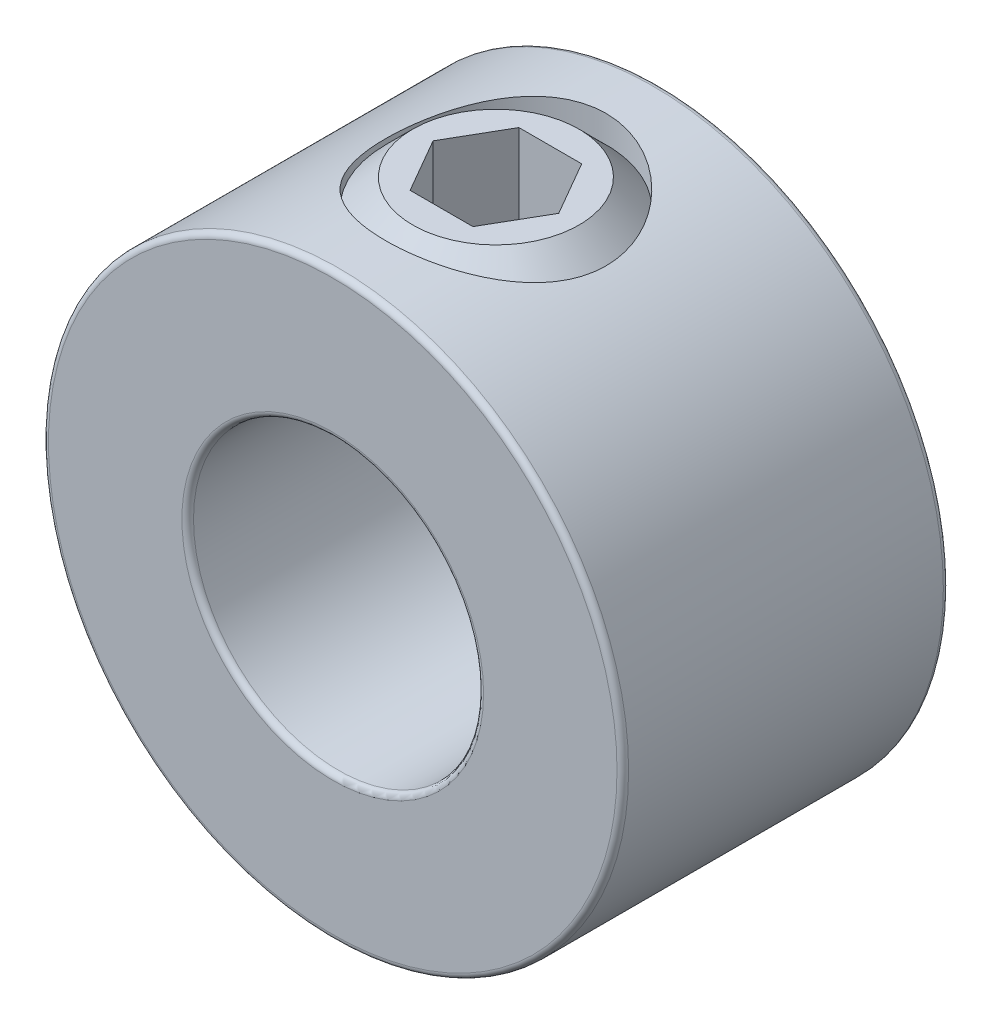
ISO-10303-21;
HEADER;
FILE_DESCRIPTION(('STEP AP214'),'2;1');
FILE_NAME('part.step','',(''),(''),'','','');
FILE_SCHEMA(('AUTOMOTIVE_DESIGN { 1 0 10303 214 1 1 1 1 }'));
ENDSEC;
DATA;
#1=APPLICATION_CONTEXT('core data for automotive mechanical design processes');
#2=APPLICATION_PROTOCOL_DEFINITION('international standard','automotive_design',2000,#1);
#3=PRODUCT_CONTEXT('',#1,'mechanical');
#4=PRODUCT('Part','Part','',(#3));
#5=PRODUCT_RELATED_PRODUCT_CATEGORY('part','',(#4));
#6=PRODUCT_DEFINITION_FORMATION('','',#4);
#7=PRODUCT_DEFINITION_CONTEXT('part definition',#1,'design');
#8=PRODUCT_DEFINITION('design','',#6,#7);
#9=PRODUCT_DEFINITION_SHAPE('','',#8);
#10=(LENGTH_UNIT() NAMED_UNIT(*) SI_UNIT(.MILLI.,.METRE.));
#11=(NAMED_UNIT(*) PLANE_ANGLE_UNIT() SI_UNIT($,.RADIAN.));
#12=(NAMED_UNIT(*) SI_UNIT($,.STERADIAN.) SOLID_ANGLE_UNIT());
#13=UNCERTAINTY_MEASURE_WITH_UNIT(LENGTH_MEASURE(1.E-05),#10,'distance_accuracy_value','');
#14=(GEOMETRIC_REPRESENTATION_CONTEXT(3) GLOBAL_UNCERTAINTY_ASSIGNED_CONTEXT((#13)) GLOBAL_UNIT_ASSIGNED_CONTEXT((#10,
#11,#12)) REPRESENTATION_CONTEXT('',''));
#15=CARTESIAN_POINT('',(0.,0.,0.));
#16=DIRECTION('',(0.,0.,1.));
#17=DIRECTION('',(1.,0.,0.));
#18=AXIS2_PLACEMENT_3D('',#15,#16,#17);
#19=CARTESIAN_POINT('',(0.,6.34999999999995,0.));
#20=DIRECTION('',(0.,1.,0.));
#21=DIRECTION('',(-1.,0.,0.));
#22=AXIS2_PLACEMENT_3D('',#19,#20,#21);
#23=PLANE('',#22);
#24=CARTESIAN_POINT('',(0.,6.34999999999995,0.));
#25=DIRECTION('',(0.,1.,0.));
#26=DIRECTION('',(-1.,0.,0.));
#27=AXIS2_PLACEMENT_3D('',#24,#25,#26);
#28=CIRCLE('',#27,1.81975161629017);
#29=CARTESIAN_POINT('',(-1.81975161629018,6.34999999999995,0.));
#30=VERTEX_POINT('',#29);
#31=EDGE_CURVE('E12',#30,#30,#28,.T.);
#32=ORIENTED_EDGE('',*,*,#31,.T.);
#33=EDGE_LOOP('',(#32));
#34=FACE_BOUND('',#33,.T.);
#35=DIRECTION('',(1.,0.,0.));
#36=VECTOR('',#35,1.);
#37=CARTESIAN_POINT('',(-0.687407664253931,6.34999999999996,-1.19062499999997));
#38=LINE('',#37,#36);
#39=CARTESIAN_POINT('',(-0.687407664253931,6.34999999999996,-1.19062499999997));
#40=VERTEX_POINT('',#39);
#41=CARTESIAN_POINT('',(0.687407664253896,6.34999999999998,-1.19062499999999));
#42=VERTEX_POINT('',#41);
#43=EDGE_CURVE('E112',#40,#42,#38,.T.);
#44=ORIENTED_EDGE('',*,*,#43,.T.);
#45=DIRECTION('',(0.5,0.,0.866025403784438));
#46=VECTOR('',#45,1.);
#47=CARTESIAN_POINT('',(0.687407664253896,6.34999999999995,-1.19062499999997));
#48=LINE('',#47,#46);
#49=CARTESIAN_POINT('',(1.37481532850779,6.34999999999995,0.));
#50=VERTEX_POINT('',#49);
#51=EDGE_CURVE('E58',#42,#50,#48,.T.);
#52=ORIENTED_EDGE('',*,*,#51,.T.);
#53=DIRECTION('',(-0.5,0.,0.866025403784439));
#54=VECTOR('',#53,1.);
#55=CARTESIAN_POINT('',(1.37481532850779,6.34999999999995,0.));
#56=LINE('',#55,#54);
#57=CARTESIAN_POINT('',(0.687407664253896,6.34999999999999,1.190625));
#58=VERTEX_POINT('',#57);
#59=EDGE_CURVE('E116',#50,#58,#56,.T.);
#60=ORIENTED_EDGE('',*,*,#59,.T.);
#61=DIRECTION('',(-1.,0.,0.));
#62=VECTOR('',#61,1.);
#63=CARTESIAN_POINT('',(0.687407664253896,6.34999999999999,1.190625));
#64=LINE('',#63,#62);
#65=CARTESIAN_POINT('',(-0.687407664253924,6.34999999999994,1.19062500000003));
#66=VERTEX_POINT('',#65);
#67=EDGE_CURVE('E179',#58,#66,#64,.T.);
#68=ORIENTED_EDGE('',*,*,#67,.T.);
#69=DIRECTION('',(-0.5,0.,-0.866025403784438));
#70=VECTOR('',#69,1.);
#71=CARTESIAN_POINT('',(-0.687407664253924,6.34999999999994,1.19062500000003));
#72=LINE('',#71,#70);
#73=CARTESIAN_POINT('',(-1.37481532850781,6.34999999999995,0.));
#74=VERTEX_POINT('',#73);
#75=EDGE_CURVE('E164',#66,#74,#72,.T.);
#76=ORIENTED_EDGE('',*,*,#75,.T.);
#77=DIRECTION('',(0.5,0.,-0.866025403784439));
#78=VECTOR('',#77,1.);
#79=CARTESIAN_POINT('',(-1.37481532850781,6.34999999999995,0.));
#80=LINE('',#79,#78);
#81=EDGE_CURVE('E160',#74,#40,#80,.T.);
#82=ORIENTED_EDGE('',*,*,#81,.T.);
#83=EDGE_LOOP('',(#44,#52,#60,#68,#76,#82));
#84=FACE_BOUND('',#83,.T.);
#85=ADVANCED_FACE('F44',(#34,#84),#23,.T.);
#86=CARTESIAN_POINT('',(0.,6.34999999999995,0.));
#87=DIRECTION('',(0.,-1.,0.));
#88=DIRECTION('',(1.,0.,0.));
#89=AXIS2_PLACEMENT_3D('',#86,#87,#88);
#90=CONICAL_SURFACE('',#89,1.81975161629017,0.785398163397449);
#91=CARTESIAN_POINT('',(0.,5.75675161629011,0.));
#92=DIRECTION('',(0.,1.,0.));
#93=DIRECTION('',(-1.,0.,0.));
#94=AXIS2_PLACEMENT_3D('',#91,#92,#93);
#95=CIRCLE('',#94,2.413);
#96=CARTESIAN_POINT('',(-2.41300000000002,5.75675161629011,0.));
#97=VERTEX_POINT('',#96);
#98=EDGE_CURVE('E51',#97,#97,#95,.T.);
#99=ORIENTED_EDGE('',*,*,#98,.T.);
#100=EDGE_LOOP('',(#99));
#101=FACE_BOUND('',#100,.T.);
#102=ORIENTED_EDGE('',*,*,#31,.F.);
#103=EDGE_LOOP('',(#102));
#104=FACE_BOUND('',#103,.T.);
#105=ADVANCED_FACE('F134',(#101,#104),#90,.T.);
#106=CARTESIAN_POINT('',(0.,3.17499999999996,0.));
#107=DIRECTION('',(0.,1.,0.));
#108=DIRECTION('',(-1.,0.,0.));
#109=AXIS2_PLACEMENT_3D('',#106,#107,#108);
#110=CYLINDRICAL_SURFACE('',#109,2.413);
#111=CARTESIAN_POINT('',(0.,3.76824838370981,0.));
#112=DIRECTION('',(0.,1.,0.));
#113=DIRECTION('',(-1.,0.,0.));
#114=AXIS2_PLACEMENT_3D('',#111,#112,#113);
#115=CIRCLE('',#114,2.413);
#116=CARTESIAN_POINT('',(-2.41300000000005,3.76824838370981,0.));
#117=VERTEX_POINT('',#116);
#118=EDGE_CURVE('E129',#117,#117,#115,.T.);
#119=ORIENTED_EDGE('',*,*,#118,.T.);
#120=EDGE_LOOP('',(#119));
#121=FACE_BOUND('',#120,.T.);
#122=ORIENTED_EDGE('',*,*,#98,.F.);
#123=EDGE_LOOP('',(#122));
#124=FACE_BOUND('',#123,.T.);
#125=ADVANCED_FACE('F137',(#121,#124),#110,.T.);
#126=CARTESIAN_POINT('',(0.,3.76824838370981,0.));
#127=DIRECTION('',(0.,1.,0.));
#128=DIRECTION('',(-1.,0.,0.));
#129=AXIS2_PLACEMENT_3D('',#126,#127,#128);
#130=CONICAL_SURFACE('',#129,2.413,0.785398163397448);
#131=CARTESIAN_POINT('',(0.,3.17499999999996,0.));
#132=DIRECTION('',(0.,1.,0.));
#133=DIRECTION('',(-1.,0.,0.));
#134=AXIS2_PLACEMENT_3D('',#131,#132,#133);
#135=CIRCLE('',#134,1.81975161629017);
#136=CARTESIAN_POINT('',(-1.81975161629015,3.17499999999996,0.));
#137=VERTEX_POINT('',#136);
#138=EDGE_CURVE('E121',#137,#137,#135,.T.);
#139=ORIENTED_EDGE('',*,*,#138,.T.);
#140=EDGE_LOOP('',(#139));
#141=FACE_BOUND('',#140,.T.);
#142=ORIENTED_EDGE('',*,*,#118,.F.);
#143=EDGE_LOOP('',(#142));
#144=FACE_BOUND('',#143,.T.);
#145=ADVANCED_FACE('F139',(#141,#144),#130,.T.);
#146=CARTESIAN_POINT('',(-1.81975161629017,3.17499999999993,0.));
#147=DIRECTION('',(0.,-1.,0.));
#148=DIRECTION('',(1.,0.,0.));
#149=AXIS2_PLACEMENT_3D('',#146,#147,#148);
#150=PLANE('',#149);
#151=CARTESIAN_POINT('',(0.,3.17499999999996,0.));
#152=DIRECTION('',(0.,1.,0.));
#153=DIRECTION('',(-1.,0.,0.));
#154=AXIS2_PLACEMENT_3D('',#151,#152,#153);
#155=CIRCLE('',#154,0.711898060451796);
#156=CARTESIAN_POINT('',(-0.711898060451782,3.17499999999996,0.));
#157=VERTEX_POINT('',#156);
#158=EDGE_CURVE('E117',#157,#157,#155,.T.);
#159=ORIENTED_EDGE('',*,*,#158,.T.);
#160=EDGE_LOOP('',(#159));
#161=FACE_BOUND('',#160,.T.);
#162=ORIENTED_EDGE('',*,*,#138,.F.);
#163=EDGE_LOOP('',(#162));
#164=FACE_BOUND('',#163,.T.);
#165=ADVANCED_FACE('F146',(#161,#164),#150,.T.);
#166=CARTESIAN_POINT('',(0.,3.17499999999996,0.));
#167=DIRECTION('',(0.,-1.,0.));
#168=DIRECTION('',(1.,0.,0.));
#169=AXIS2_PLACEMENT_3D('',#166,#167,#168);
#170=CONICAL_SURFACE('',#169,0.711898060451796,0.785398163397448);
#171=CARTESIAN_POINT('',(0.,3.88689806045177,0.));
#172=VERTEX_POINT('',#171);
#173=VERTEX_LOOP('',#172);
#174=FACE_BOUND('',#173,.T.);
#175=ORIENTED_EDGE('',*,*,#158,.F.);
#176=EDGE_LOOP('',(#175));
#177=FACE_BOUND('',#176,.T.);
#178=ADVANCED_FACE('F213',(#174,#177),#170,.F.);
#179=CARTESIAN_POINT('',(0.687407664253903,3.96874999999994,-1.19062499999995));
#180=DIRECTION('',(-0.866025403784439,0.,0.5));
#181=DIRECTION('',(0.5,0.,0.866025403784438));
#182=AXIS2_PLACEMENT_3D('',#179,#180,#181);
#183=PLANE('',#182);
#184=ORIENTED_EDGE('',*,*,#51,.F.);
#185=DIRECTION('',(0.,1.,0.));
#186=VECTOR('',#185,1.);
#187=CARTESIAN_POINT('',(0.687407664253903,3.96874999999994,-1.19062499999995));
#188=LINE('',#187,#186);
#189=CARTESIAN_POINT('',(0.687407664253903,3.96874999999994,-1.19062499999995));
#190=VERTEX_POINT('',#189);
#191=EDGE_CURVE('E111',#190,#42,#188,.T.);
#192=ORIENTED_EDGE('',*,*,#191,.F.);
#193=DIRECTION('',(0.5,0.,0.866025403784438));
#194=VECTOR('',#193,1.);
#195=CARTESIAN_POINT('',(0.687407664253903,3.96874999999994,-1.19062499999995));
#196=LINE('',#195,#194);
#197=CARTESIAN_POINT('',(1.37481532850781,3.96874999999994,0.));
#198=VERTEX_POINT('',#197);
#199=EDGE_CURVE('E102',#190,#198,#196,.T.);
#200=ORIENTED_EDGE('',*,*,#199,.T.);
#201=DIRECTION('',(0.,1.,0.));
#202=VECTOR('',#201,1.);
#203=CARTESIAN_POINT('',(1.37481532850781,3.96874999999994,0.));
#204=LINE('',#203,#202);
#205=EDGE_CURVE('E110',#198,#50,#204,.T.);
#206=ORIENTED_EDGE('',*,*,#205,.T.);
#207=EDGE_LOOP('',(#184,#192,#200,#206));
#208=FACE_BOUND('',#207,.T.);
#209=ADVANCED_FACE('F109',(#208),#183,.T.);
#210=CARTESIAN_POINT('',(1.37481532850781,3.96874999999994,0.));
#211=DIRECTION('',(-0.866025403784438,0.,-0.5));
#212=DIRECTION('',(-0.5,0.,0.866025403784439));
#213=AXIS2_PLACEMENT_3D('',#210,#211,#212);
#214=PLANE('',#213);
#215=ORIENTED_EDGE('',*,*,#59,.F.);
#216=ORIENTED_EDGE('',*,*,#205,.F.);
#217=DIRECTION('',(-0.5,0.,0.866025403784439));
#218=VECTOR('',#217,1.);
#219=CARTESIAN_POINT('',(1.37481532850781,3.96874999999994,0.));
#220=LINE('',#219,#218);
#221=CARTESIAN_POINT('',(0.687407664253924,3.96874999999994,1.19062500000003));
#222=VERTEX_POINT('',#221);
#223=EDGE_CURVE('E98',#198,#222,#220,.T.);
#224=ORIENTED_EDGE('',*,*,#223,.T.);
#225=DIRECTION('',(0.,1.,0.));
#226=VECTOR('',#225,1.);
#227=CARTESIAN_POINT('',(0.687407664253924,3.96874999999994,1.19062500000003));
#228=LINE('',#227,#226);
#229=EDGE_CURVE('E118',#222,#58,#228,.T.);
#230=ORIENTED_EDGE('',*,*,#229,.T.);
#231=EDGE_LOOP('',(#215,#216,#224,#230));
#232=FACE_BOUND('',#231,.T.);
#233=ADVANCED_FACE('F114',(#232),#214,.T.);
#234=CARTESIAN_POINT('',(0.687407664253924,3.96874999999994,1.19062500000003));
#235=DIRECTION('',(0.,0.,-1.));
#236=DIRECTION('',(-1.,0.,0.));
#237=AXIS2_PLACEMENT_3D('',#234,#235,#236);
#238=PLANE('',#237);
#239=ORIENTED_EDGE('',*,*,#67,.F.);
#240=ORIENTED_EDGE('',*,*,#229,.F.);
#241=DIRECTION('',(-1.,0.,0.));
#242=VECTOR('',#241,1.);
#243=CARTESIAN_POINT('',(0.687407664253924,3.96874999999994,1.19062500000003));
#244=LINE('',#243,#242);
#245=CARTESIAN_POINT('',(-0.68740766425391,3.96874999999993,1.19062500000001));
#246=VERTEX_POINT('',#245);
#247=EDGE_CURVE('E104',#222,#246,#244,.T.);
#248=ORIENTED_EDGE('',*,*,#247,.T.);
#249=DIRECTION('',(0.,1.,0.));
#250=VECTOR('',#249,1.);
#251=CARTESIAN_POINT('',(-0.68740766425391,3.96874999999993,1.19062500000001));
#252=LINE('',#251,#250);
#253=EDGE_CURVE('E123',#246,#66,#252,.T.);
#254=ORIENTED_EDGE('',*,*,#253,.T.);
#255=EDGE_LOOP('',(#239,#240,#248,#254));
#256=FACE_BOUND('',#255,.T.);
#257=ADVANCED_FACE('F177',(#256),#238,.T.);
#258=CARTESIAN_POINT('',(-0.68740766425391,3.96874999999993,1.19062500000001));
#259=DIRECTION('',(0.866025403784438,0.,-0.5));
#260=DIRECTION('',(-0.5,0.,-0.866025403784438));
#261=AXIS2_PLACEMENT_3D('',#258,#259,#260);
#262=PLANE('',#261);
#263=ORIENTED_EDGE('',*,*,#75,.F.);
#264=ORIENTED_EDGE('',*,*,#253,.F.);
#265=DIRECTION('',(-0.5,0.,-0.866025403784438));
#266=VECTOR('',#265,1.);
#267=CARTESIAN_POINT('',(-0.68740766425391,3.96874999999993,1.19062500000001));
#268=LINE('',#267,#266);
#269=CARTESIAN_POINT('',(-1.37481532850782,3.96874999999994,0.));
#270=VERTEX_POINT('',#269);
#271=EDGE_CURVE('E190',#246,#270,#268,.T.);
#272=ORIENTED_EDGE('',*,*,#271,.T.);
#273=DIRECTION('',(0.,1.,0.));
#274=VECTOR('',#273,1.);
#275=CARTESIAN_POINT('',(-1.37481532850782,3.96874999999994,0.));
#276=LINE('',#275,#274);
#277=EDGE_CURVE('E172',#270,#74,#276,.T.);
#278=ORIENTED_EDGE('',*,*,#277,.T.);
#279=EDGE_LOOP('',(#263,#264,#272,#278));
#280=FACE_BOUND('',#279,.T.);
#281=ADVANCED_FACE('F181',(#280),#262,.T.);
#282=CARTESIAN_POINT('',(-1.37481532850782,3.96874999999994,0.));
#283=DIRECTION('',(0.866025403784438,0.,0.499999999999999));
#284=DIRECTION('',(0.5,0.,-0.866025403784439));
#285=AXIS2_PLACEMENT_3D('',#282,#283,#284);
#286=PLANE('',#285);
#287=ORIENTED_EDGE('',*,*,#81,.F.);
#288=ORIENTED_EDGE('',*,*,#277,.F.);
#289=DIRECTION('',(0.5,0.,-0.866025403784439));
#290=VECTOR('',#289,1.);
#291=CARTESIAN_POINT('',(-1.37481532850782,3.96874999999994,0.));
#292=LINE('',#291,#290);
#293=CARTESIAN_POINT('',(-0.687407664253924,3.96874999999995,-1.19062499999997));
#294=VERTEX_POINT('',#293);
#295=EDGE_CURVE('E188',#270,#294,#292,.T.);
#296=ORIENTED_EDGE('',*,*,#295,.T.);
#297=DIRECTION('',(0.,1.,0.));
#298=VECTOR('',#297,1.);
#299=CARTESIAN_POINT('',(-0.687407664253924,3.96874999999995,-1.19062499999997));
#300=LINE('',#299,#298);
#301=EDGE_CURVE('E169',#294,#40,#300,.T.);
#302=ORIENTED_EDGE('',*,*,#301,.T.);
#303=EDGE_LOOP('',(#287,#288,#296,#302));
#304=FACE_BOUND('',#303,.T.);
#305=ADVANCED_FACE('F194',(#304),#286,.T.);
#306=CARTESIAN_POINT('',(-0.687407664253924,3.96874999999995,-1.19062499999997));
#307=DIRECTION('',(0.,0.,1.));
#308=DIRECTION('',(1.,0.,0.));
#309=AXIS2_PLACEMENT_3D('',#306,#307,#308);
#310=PLANE('',#309);
#311=ORIENTED_EDGE('',*,*,#43,.F.);
#312=ORIENTED_EDGE('',*,*,#301,.F.);
#313=DIRECTION('',(1.,0.,0.));
#314=VECTOR('',#313,1.);
#315=CARTESIAN_POINT('',(-0.687407664253924,3.96874999999995,-1.19062499999997));
#316=LINE('',#315,#314);
#317=EDGE_CURVE('E170',#294,#190,#316,.T.);
#318=ORIENTED_EDGE('',*,*,#317,.T.);
#319=ORIENTED_EDGE('',*,*,#191,.T.);
#320=EDGE_LOOP('',(#311,#312,#318,#319));
#321=FACE_BOUND('',#320,.T.);
#322=ADVANCED_FACE('F195',(#321),#310,.T.);
#323=CARTESIAN_POINT('',(1.37481532850781,3.96874999999994,0.));
#324=DIRECTION('',(0.,-1.,0.));
#325=DIRECTION('',(0.,0.,-1.));
#326=AXIS2_PLACEMENT_3D('',#323,#324,#325);
#327=PLANE('',#326);
#328=ORIENTED_EDGE('',*,*,#199,.F.);
#329=ORIENTED_EDGE('',*,*,#317,.F.);
#330=ORIENTED_EDGE('',*,*,#295,.F.);
#331=ORIENTED_EDGE('',*,*,#271,.F.);
#332=ORIENTED_EDGE('',*,*,#247,.F.);
#333=ORIENTED_EDGE('',*,*,#223,.F.);
#334=EDGE_LOOP('',(#328,#329,#330,#331,#332,#333));
#335=FACE_BOUND('',#334,.T.);
#336=ADVANCED_FACE('F100',(#335),#327,.F.);
#337=CLOSED_SHELL('',(#85,#105,#125,#145,#165,#178,#209,#233,#257,#281,#305,#322,#336));
#338=MANIFOLD_SOLID_BREP('B2',#337);
#339=CARTESIAN_POINT('',(0.,0.,3.57187499999997));
#340=DIRECTION('',(0.,0.,0.999999999999996));
#341=DIRECTION('',(0.999999999999996,0.,0.));
#342=AXIS2_PLACEMENT_3D('',#339,#340,#341);
#343=PLANE('',#342);
#344=CARTESIAN_POINT('',(0.,0.,3.57187499999997));
#345=DIRECTION('',(0.,0.,0.999999999999996));
#346=DIRECTION('',(0.999999999999996,0.,0.));
#347=AXIS2_PLACEMENT_3D('',#344,#345,#346);
#348=CIRCLE('',#347,3.302);
#349=CARTESIAN_POINT('',(3.30199999999997,0.,3.57187499999997));
#350=VERTEX_POINT('',#349);
#351=EDGE_CURVE('E309',#350,#350,#348,.F.);
#352=ORIENTED_EDGE('',*,*,#351,.T.);
#353=EDGE_LOOP('',(#352));
#354=FACE_BOUND('',#353,.T.);
#355=CARTESIAN_POINT('',(0.,0.,3.57187499999997));
#356=DIRECTION('',(0.,0.,0.999999999999996));
#357=DIRECTION('',(0.999999999999996,0.,0.));
#358=AXIS2_PLACEMENT_3D('',#355,#356,#357);
#359=CIRCLE('',#358,6.223);
#360=CARTESIAN_POINT('',(6.22299999999995,0.,3.57187499999997));
#361=VERTEX_POINT('',#360);
#362=EDGE_CURVE('E313',#361,#361,#359,.T.);
#363=ORIENTED_EDGE('',*,*,#362,.T.);
#364=EDGE_LOOP('',(#363));
#365=FACE_BOUND('',#364,.T.);
#366=ADVANCED_FACE('F298',(#354,#365),#343,.T.);
#367=CARTESIAN_POINT('',(0.,0.,-3.571875));
#368=DIRECTION('',(0.,0.,0.999999999999996));
#369=DIRECTION('',(0.999999999999996,0.,0.));
#370=AXIS2_PLACEMENT_3D('',#367,#368,#369);
#371=PLANE('',#370);
#372=CARTESIAN_POINT('',(0.,0.,-3.571875));
#373=DIRECTION('',(0.,0.,0.999999999999996));
#374=DIRECTION('',(0.999999999999996,0.,0.));
#375=AXIS2_PLACEMENT_3D('',#372,#373,#374);
#376=CIRCLE('',#375,3.302);
#377=CARTESIAN_POINT('',(3.30200000000006,0.,-3.57187500000001));
#378=VERTEX_POINT('',#377);
#379=EDGE_CURVE('E324',#378,#378,#376,.T.);
#380=ORIENTED_EDGE('',*,*,#379,.T.);
#381=EDGE_LOOP('',(#380));
#382=FACE_BOUND('',#381,.T.);
#383=CARTESIAN_POINT('',(0.,0.,-3.571875));
#384=DIRECTION('',(0.,0.,0.999999999999996));
#385=DIRECTION('',(0.999999999999996,0.,0.));
#386=AXIS2_PLACEMENT_3D('',#383,#384,#385);
#387=CIRCLE('',#386,6.223);
#388=CARTESIAN_POINT('',(6.22300000000004,0.,-3.57187500000001));
#389=VERTEX_POINT('',#388);
#390=EDGE_CURVE('E327',#389,#389,#387,.F.);
#391=ORIENTED_EDGE('',*,*,#390,.T.);
#392=EDGE_LOOP('',(#391));
#393=FACE_BOUND('',#392,.T.);
#394=ADVANCED_FACE('F361',(#382,#393),#371,.F.);
#395=CARTESIAN_POINT('',(0.,0.,3.57187499999997));
#396=DIRECTION('',(0.,0.,-0.999999999999996));
#397=DIRECTION('',(-0.999999999999996,0.,0.));
#398=AXIS2_PLACEMENT_3D('',#395,#396,#397);
#399=CYLINDRICAL_SURFACE('',#398,6.35);
#400=CARTESIAN_POINT('',(1.17961196366423E-13,0.,-3.44487500000004));
#401=DIRECTION('',(0.,0.,0.999999999999996));
#402=DIRECTION('',(0.999999999999996,0.,0.));
#403=AXIS2_PLACEMENT_3D('',#400,#401,#402);
#404=CIRCLE('',#403,6.35);
#405=CARTESIAN_POINT('',(6.35000000000009,0.,-3.44487500000005));
#406=VERTEX_POINT('',#405);
#407=EDGE_CURVE('E43',#406,#406,#404,.T.);
#408=ORIENTED_EDGE('',*,*,#407,.T.);
#409=EDGE_LOOP('',(#408));
#410=FACE_BOUND('',#409,.T.);
#411=CARTESIAN_POINT('',(2.77555756156289E-13,0.,3.4448749999999));
#412=DIRECTION('',(0.,0.,0.999999999999996));
#413=DIRECTION('',(0.999999999999996,0.,0.));
#414=AXIS2_PLACEMENT_3D('',#411,#412,#413);
#415=CIRCLE('',#414,6.35);
#416=CARTESIAN_POINT('',(6.35000000000025,0.,3.4448749999999));
#417=VERTEX_POINT('',#416);
#418=EDGE_CURVE('E305',#417,#417,#415,.F.);
#419=ORIENTED_EDGE('',*,*,#418,.T.);
#420=EDGE_LOOP('',(#419));
#421=FACE_BOUND('',#420,.T.);
#422=CARTESIAN_POINT('',(-1.11022302462516E-13,6.35000000000011,-2.41299999999983));
#423=CARTESIAN_POINT('',(0.130555931467885,6.3500039896902,-2.41300527534585));
#424=CARTESIAN_POINT('',(0.261076241377685,6.34593890816643,-2.4023714543112));
#425=CARTESIAN_POINT('',(0.518209446534977,6.33012963929959,-2.36029479676431));
#426=CARTESIAN_POINT('',(0.644823015088816,6.31838678300943,-2.32885556715796));
#427=CARTESIAN_POINT('',(0.890396734122868,6.28848040494008,-2.24644511602086));
#428=CARTESIAN_POINT('',(1.00937135935971,6.2703294770509,-2.19551218938439));
#429=CARTESIAN_POINT('',(1.23707694907293,6.229409320604,-2.0757576456193));
#430=CARTESIAN_POINT('',(1.34580507871122,6.20663881943742,-2.00693109764786));
#431=CARTESIAN_POINT('',(1.55465440906242,6.1577193277974,-1.85022277092636));
#432=CARTESIAN_POINT('',(1.6542719287505,6.13147296383118,-1.76170041625001));
#433=CARTESIAN_POINT('',(1.83765571561733,6.07903240405,-1.56947315042893));
#434=CARTESIAN_POINT('',(1.92141693988134,6.05283822744466,-1.46576342765108));
#435=CARTESIAN_POINT('',(2.07395660623909,6.00232668170517,-1.24113386470115));
#436=CARTESIAN_POINT('',(2.14201618015847,5.97812365120717,-1.11969756154781));
#437=CARTESIAN_POINT('',(2.25652093858864,5.93585432476052,-0.866038380432392));
#438=CARTESIAN_POINT('',(2.30297502037551,5.91778550353566,-0.733819969020848));
#439=CARTESIAN_POINT('',(2.37094947712191,5.89087364983901,-0.468153631898075));
#440=CARTESIAN_POINT('',(2.39343294050418,5.88167580744486,-0.334989300795521));
#441=CARTESIAN_POINT('',(2.41583880524761,5.87251090464595,-0.0664845962936139));
#442=CARTESIAN_POINT('',(2.41577084821781,5.87253989940935,0.068854822423273));
#443=CARTESIAN_POINT('',(2.3938109010888,5.88152011871462,0.328972227003076));
#444=CARTESIAN_POINT('',(2.37326609797157,5.88992057372015,0.453886522563301));
#445=CARTESIAN_POINT('',(2.31316652422961,5.9137800882314,0.69833970499083));
#446=CARTESIAN_POINT('',(2.27360881167124,5.92924024009009,0.817877756841858));
#447=CARTESIAN_POINT('',(2.17588364092757,5.96580146890704,1.05089161528512));
#448=CARTESIAN_POINT('',(2.11737290423764,5.98700531598422,1.16420661484101));
#449=CARTESIAN_POINT('',(1.98364217411341,6.03263175509439,1.37979639920581));
#450=CARTESIAN_POINT('',(1.9084163039526,6.05705547794387,1.4820672822726));
#451=CARTESIAN_POINT('',(1.73726689770551,6.10842961275011,1.68010694238857));
#452=CARTESIAN_POINT('',(1.64027173491622,6.13543795015632,1.77493688260014));
#453=CARTESIAN_POINT('',(1.43144868882476,6.18748920351002,1.94726806056406));
#454=CARTESIAN_POINT('',(1.3196184065319,6.21253180053244,2.02476649017823));
#455=CARTESIAN_POINT('',(1.08185265975396,6.25835188225346,2.16130771487289));
#456=CARTESIAN_POINT('',(0.955717417234692,6.27905339803362,2.22002994310977));
#457=CARTESIAN_POINT('',(0.694375189035212,6.31329326294072,2.31510736575222));
#458=CARTESIAN_POINT('',(0.559172376611331,6.32683488218734,2.35147277236415));
#459=CARTESIAN_POINT('',(0.291428150212632,6.34465019729929,2.39898109857704));
#460=CARTESIAN_POINT('',(0.159141645079903,6.34938771868043,2.41138775288994));
#461=CARTESIAN_POINT('',(-0.105693065348196,6.3504998105715,2.41431626348453));
#462=CARTESIAN_POINT('',(-0.238241203821976,6.34687629478173,2.40484312768041));
#463=CARTESIAN_POINT('',(-0.494323602805277,6.33197908606414,2.36523562382564));
#464=CARTESIAN_POINT('',(-0.618006844411981,6.32101461634214,2.33593589818841));
#465=CARTESIAN_POINT('',(-0.858609565435878,6.29285092848218,2.25861304376359));
#466=CARTESIAN_POINT('',(-0.97552816391411,6.27565090041605,2.21058748264151));
#467=CARTESIAN_POINT('',(-1.20317276582358,6.23607457125027,2.09563503713989));
#468=CARTESIAN_POINT('',(-1.31361214996716,6.21355984396605,2.02818967610486));
#469=CARTESIAN_POINT('',(-1.52197988578177,6.16583504517286,1.8768959588361));
#470=CARTESIAN_POINT('',(-1.61990351002368,6.14062396176687,1.79304143465595));
#471=CARTESIAN_POINT('',(-1.80656807112923,6.08841217199762,1.6054327249607));
#472=CARTESIAN_POINT('',(-1.89441393314816,6.06139435477814,1.5007904098218));
#473=CARTESIAN_POINT('',(-2.05148411432639,6.01005496187555,1.27772800811268));
#474=CARTESIAN_POINT('',(-2.12070651399828,5.98573366426973,1.15930650314617));
#475=CARTESIAN_POINT('',(-2.23870023772441,5.94261798623814,0.91092274853848));
#476=CARTESIAN_POINT('',(-2.2873646634246,5.92385264334903,0.780904332023307));
#477=CARTESIAN_POINT('',(-2.3617780094681,5.89458517077402,0.513602694331941));
#478=CARTESIAN_POINT('',(-2.38754162954709,5.8840777409414,0.376324193363525));
#479=CARTESIAN_POINT('',(-2.41408994040526,5.87323215610146,0.108127165215294));
#480=CARTESIAN_POINT('',(-2.41640623148605,5.87227054588008,-0.02261573438422));
#481=CARTESIAN_POINT('',(-2.39993732046539,5.87902022534257,-0.282524873396708));
#482=CARTESIAN_POINT('',(-2.38115423316011,5.88673064582668,-0.411691269511418));
#483=CARTESIAN_POINT('',(-2.32422421188548,5.90943043237588,-0.660552265849554));
#484=CARTESIAN_POINT('',(-2.28672002796375,5.92417751295517,-0.78041791949191));
#485=CARTESIAN_POINT('',(-2.19398528189384,5.95914188553001,-1.01222145618625));
#486=CARTESIAN_POINT('',(-2.13875018285565,5.9793605773636,-1.12415730124401));
#487=CARTESIAN_POINT('',(-2.00869997639478,6.02433337271123,-1.34342800575816));
#488=CARTESIAN_POINT('',(-1.93299650808651,6.04927206356279,-1.45019762417181));
#489=CARTESIAN_POINT('',(-1.76551836882636,6.10025417003155,-1.65000619367233));
#490=CARTESIAN_POINT('',(-1.67373852090434,6.12629793945651,-1.74304070389431));
#491=CARTESIAN_POINT('',(-1.47055494697209,6.17831294001546,-1.91807209951938));
#492=CARTESIAN_POINT('',(-1.35833856072126,6.20419794006476,-1.99915556641371));
#493=CARTESIAN_POINT('',(-1.12096041375393,6.25144642675376,-2.14129762074752));
#494=CARTESIAN_POINT('',(-0.99579705069319,6.27280935273327,-2.20235372565022));
#495=CARTESIAN_POINT('',(-0.728778395788109,6.30955475572155,-2.304992636162));
#496=CARTESIAN_POINT('',(-0.586384697783494,6.32454657619373,-2.34532880523641));
#497=CARTESIAN_POINT('',(-0.29597670525171,6.34476431329023,-2.39932232882261));
#498=CARTESIAN_POINT('',(-0.147965475024591,6.34999547828758,-2.41299402119006));
#499=CARTESIAN_POINT('',(-1.11022302462516E-13,6.35000000000011,-2.41299999999983));
#500=B_SPLINE_CURVE_WITH_KNOTS('',3,(#422,#423,#424,#425,#426,#427,#428,#429,#430,#431,#432,
#433,#434,#435,#436,#437,#438,#439,#440,#441,#442,#443,#444,#445,#446,#447,#448,#449,#450,#451,
#452,#453,#454,#455,#456,#457,#458,#459,#460,#461,#462,#463,#464,#465,#466,#467,#468,#469,#470,
#471,#472,#473,#474,#475,#476,#477,#478,#479,#480,#481,#482,#483,#484,#485,#486,#487,#488,#489,
#490,#491,#492,#493,#494,#495,#496,#497,#498,#499),.UNSPECIFIED.,.T.,.F.,(4,2,2,2,2,2,2,2,2,2,2,
2,2,2,2,2,2,2,2,2,2,2,2,2,2,2,2,2,2,2,2,2,2,2,2,2,2,2,4),(0.,0.391121887064292,
0.782175985486408,1.17246577830249,1.56286323524992,1.96854634212734,2.37435825594042,
2.79613130529416,3.21773051175698,3.62166628723509,4.02542936468648,4.40427313209392,
4.78317553819679,5.16936515238202,5.55569075901501,5.96873424705131,6.38184461005458,
6.80167192308677,7.22130732355903,7.61812936188629,8.01486058335604,8.39585156202371,
8.77689204483073,9.16923685275017,9.56172942118028,9.97761353597023,10.3935404987955,
10.811604363113,11.2293996833678,11.6197130905883,12.0099873800857,12.3876994067836,
12.7655081575187,13.1635000328784,13.5616203073397,13.9821012344605,14.4026342635627,
14.8461505355471,15.289428256913),.UNSPECIFIED.);
#501=CARTESIAN_POINT('',(-1.11022302462516E-13,6.35000000000011,-2.41299999999983));
#502=VERTEX_POINT('',#501);
#503=EDGE_CURVE('E330',#502,#502,#500,.T.);
#504=ORIENTED_EDGE('',*,*,#503,.T.);
#505=EDGE_LOOP('',(#504));
#506=FACE_BOUND('',#505,.T.);
#507=ADVANCED_FACE('F357',(#410,#421,#506),#399,.T.);
#508=CARTESIAN_POINT('',(0.,0.,3.57187499999997));
#509=DIRECTION('',(0.,0.,-0.999999999999996));
#510=DIRECTION('',(-0.999999999999996,0.,0.));
#511=AXIS2_PLACEMENT_3D('',#508,#509,#510);
#512=CYLINDRICAL_SURFACE('',#511,3.175);
#513=CARTESIAN_POINT('',(1.17961196366423E-13,0.,-3.44487500000004));
#514=DIRECTION('',(0.,0.,0.999999999999996));
#515=DIRECTION('',(0.999999999999996,0.,0.));
#516=AXIS2_PLACEMENT_3D('',#513,#514,#515);
#517=CIRCLE('',#516,3.175);
#518=CARTESIAN_POINT('',(3.1750000000001,0.,-3.44487500000004));
#519=VERTEX_POINT('',#518);
#520=EDGE_CURVE('E318',#519,#519,#517,.F.);
#521=ORIENTED_EDGE('',*,*,#520,.T.);
#522=EDGE_LOOP('',(#521));
#523=FACE_BOUND('',#522,.T.);
#524=CARTESIAN_POINT('',(2.77555756156289E-13,0.,3.4448749999999));
#525=DIRECTION('',(0.,0.,0.999999999999996));
#526=DIRECTION('',(0.999999999999996,0.,0.));
#527=AXIS2_PLACEMENT_3D('',#524,#525,#526);
#528=CIRCLE('',#527,3.175);
#529=CARTESIAN_POINT('',(3.17500000000026,0.,3.4448749999999));
#530=VERTEX_POINT('',#529);
#531=EDGE_CURVE('E321',#530,#530,#528,.T.);
#532=ORIENTED_EDGE('',*,*,#531,.T.);
#533=EDGE_LOOP('',(#532));
#534=FACE_BOUND('',#533,.T.);
#535=CARTESIAN_POINT('',(2.22044604925031E-13,3.175,-2.41299999999989));
#536=CARTESIAN_POINT('',(0.117443171605423,3.17499092904909,-2.41299058031888));
#537=CARTESIAN_POINT('',(0.235038188419463,3.16841692674323,-2.40435818472683));
#538=CARTESIAN_POINT('',(0.466484967913433,3.14271336140826,-2.37038175457781));
#539=CARTESIAN_POINT('',(0.580328596183497,3.12355818632329,-2.34500362950089));
#540=CARTESIAN_POINT('',(0.800336935463724,3.07452724978753,-2.27928432631252));
#541=CARTESIAN_POINT('',(0.906543039514126,3.04471549355355,-2.23903243487975));
#542=CARTESIAN_POINT('',(1.10997011785933,2.97659455342074,-2.14548015839206));
#543=CARTESIAN_POINT('',(1.20719255384311,2.93828675533256,-2.09218190121567));
#544=CARTESIAN_POINT('',(1.40022726688531,2.85170030734845,-1.96882085307538));
#545=CARTESIAN_POINT('',(1.49506365463588,2.80282512985169,-1.89765858122508));
#546=CARTESIAN_POINT('',(1.67223382567988,2.70087605460914,-1.74356411581761));
#547=CARTESIAN_POINT('',(1.75454859398138,2.64779595363655,-1.66061438438294));
#548=CARTESIAN_POINT('',(1.92203888294103,2.52961353519566,-1.46565859240809));
#549=CARTESIAN_POINT('',(2.00423140536029,2.46431243671428,-1.35120048467092));
#550=CARTESIAN_POINT('',(2.14857118710826,2.33951215894298,-1.10735736644862));
#551=CARTESIAN_POINT('',(2.21074385995934,2.28000569136529,-0.97799156571779));
#552=CARTESIAN_POINT('',(2.29462037317515,2.19490180220154,-0.752497308608482));
#553=CARTESIAN_POINT('',(2.32287346333008,2.16472241167535,-0.660558279072178));
#554=CARTESIAN_POINT('',(2.36849823013459,2.11470881226269,-0.471390387002406));
#555=CARTESIAN_POINT('',(2.38589523743033,2.09485053921889,-0.374174418254756));
#556=CARTESIAN_POINT('',(2.4087035847158,2.06860028206595,-0.175460476776948));
#557=CARTESIAN_POINT('',(2.41399594315121,2.06234200752833,-0.073929905731425));
#558=CARTESIAN_POINT('',(2.41169213967829,2.06503422028953,0.128798184800889));
#559=CARTESIAN_POINT('',(2.40409306334683,2.07398814667795,0.229995623792648));
#560=CARTESIAN_POINT('',(2.37836508518818,2.10340433920655,0.416917246134671));
#561=CARTESIAN_POINT('',(2.361561712655,2.12240914649673,0.503073429560242));
#562=CARTESIAN_POINT('',(2.31942910669353,2.16837457604804,0.671064962974148));
#563=CARTESIAN_POINT('',(2.29409116468365,2.19534332114499,0.752895800354689));
#564=CARTESIAN_POINT('',(2.21702947004256,2.2737691661193,0.962631680289639));
#565=CARTESIAN_POINT('',(2.15880606368406,2.32983777456745,1.08642083974009));
#566=CARTESIAN_POINT('',(2.02405846701675,2.44783368287615,1.32063556736211));
#567=CARTESIAN_POINT('',(1.94748865288631,2.50977535205405,1.43102676980395));
#568=CARTESIAN_POINT('',(1.77457755480707,2.63500191833989,1.64086400526659));
#569=CARTESIAN_POINT('',(1.6777290856927,2.69827393808612,1.73990181478285));
#570=CARTESIAN_POINT('',(1.46641465679793,2.81868720555886,1.92133244794266));
#571=CARTESIAN_POINT('',(1.35198192561176,2.87583967861328,2.00375600179539));
#572=CARTESIAN_POINT('',(1.13021846917964,2.96897239724266,2.13504920976458));
#573=CARTESIAN_POINT('',(1.0257346964846,3.00691100546587,2.18732233798605));
#574=CARTESIAN_POINT('',(0.807524498934851,3.07269924184983,2.27691743542358));
#575=CARTESIAN_POINT('',(0.693803632023707,3.10055488265639,2.31424831636691));
#576=CARTESIAN_POINT('',(0.458986561176822,3.14392869528761,2.37204565582184));
#577=CARTESIAN_POINT('',(0.337846653718228,3.15936426972389,2.39239924216473));
#578=CARTESIAN_POINT('',(0.0929212408274609,3.17600778354889,2.41433718167045));
#579=CARTESIAN_POINT('',(-0.0308628412676575,3.17722319336257,2.41593138989238));
#580=CARTESIAN_POINT('',(-0.263113673769182,3.16598164725181,2.40112430213961));
#581=CARTESIAN_POINT('',(-0.371784896473934,3.15499411480434,2.38665711938392));
#582=CARTESIAN_POINT('',(-0.584657379974045,3.12256258934282,2.34361709819451));
#583=CARTESIAN_POINT('',(-0.688857782558424,3.10111659842472,2.31504156459621));
#584=CARTESIAN_POINT('',(-0.893151752270426,3.04866013703257,2.24429284461139));
#585=CARTESIAN_POINT('',(-0.993066473951723,3.01741404656937,2.20178337061755));
#586=CARTESIAN_POINT('',(-1.18427030490259,2.94762615076736,2.10512741976434));
#587=CARTESIAN_POINT('',(-1.27555811070533,2.90908324556453,2.05097918840415));
#588=CARTESIAN_POINT('',(-1.4629408219303,2.82008518778887,1.92283493337206));
#589=CARTESIAN_POINT('',(-1.55736336530943,2.76871323654285,1.84703979297127));
#590=CARTESIAN_POINT('',(-1.73302663401564,2.66229345480279,1.68334400808505));
#591=CARTESIAN_POINT('',(-1.81424018707214,2.60723836781937,1.59541908083353));
#592=CARTESIAN_POINT('',(-1.93310120506625,2.51929011373862,1.44596227809653));
#593=CARTESIAN_POINT('',(-1.97518148865629,2.48634042838268,1.38794003709876));
#594=CARTESIAN_POINT('',(-2.05424288960506,2.42143291492006,1.26799956797451));
#595=CARTESIAN_POINT('',(-2.09122218168253,2.38947544500999,1.20607995673936));
#596=CARTESIAN_POINT('',(-2.1940506976386,2.29677780916449,1.0147092151367));
#597=CARTESIAN_POINT('',(-2.25209423008391,2.23897594817098,0.879267670433677));
#598=CARTESIAN_POINT('',(-2.32600727289698,2.16148731453324,0.648667618119872));
#599=CARTESIAN_POINT('',(-2.34951337659761,2.13568591161404,0.557995127674443));
#600=CARTESIAN_POINT('',(-2.3859773628601,2.09487284834014,0.372275602813055));
#601=CARTESIAN_POINT('',(-2.39896041795903,2.07983544919015,0.277239585981816));
#602=CARTESIAN_POINT('',(-2.41347202601577,2.06298898322375,0.0843820043041391));
#603=CARTESIAN_POINT('',(-2.41491881071063,2.06127434940028,-0.0134545208326479));
#604=CARTESIAN_POINT('',(-2.40600289841213,2.07166816759279,-0.207882136481059));
#605=CARTESIAN_POINT('',(-2.39562846174625,2.08379036100336,-0.304471892411191));
#606=CARTESIAN_POINT('',(-2.36137219311361,2.12256830664755,-0.508834367655929));
#607=CARTESIAN_POINT('',(-2.33557340769402,2.15126142901361,-0.615881798172345));
#608=CARTESIAN_POINT('',(-2.27108364148604,2.21923176610739,-0.822515613730481));
#609=CARTESIAN_POINT('',(-2.23235922106739,2.25853638265599,-0.922081817130614));
#610=CARTESIAN_POINT('',(-2.12610942507643,2.35955877527058,-1.1505330969378));
#611=CARTESIAN_POINT('',(-2.05324191025253,2.42403799567894,-1.27569998264058));
#612=CARTESIAN_POINT('',(-1.88728411653409,2.55539518076964,-1.51043185969249));
#613=CARTESIAN_POINT('',(-1.7941707688202,2.62227580852251,-1.61997881541946));
#614=CARTESIAN_POINT('',(-1.58693666845881,2.75272337581287,-1.82362287315757));
#615=CARTESIAN_POINT('',(-1.47252844795797,2.81622750409901,-1.91747043629873));
#616=CARTESIAN_POINT('',(-1.22472214874901,2.9324540569065,-2.08441858845932));
#617=CARTESIAN_POINT('',(-1.09136873492946,2.98520114921483,-2.15756679766157));
#618=CARTESIAN_POINT('',(-0.848324156262946,3.0614331007041,-2.26167625095059));
#619=CARTESIAN_POINT('',(-0.742491250018551,3.08897584082978,-2.2987156919465));
#620=CARTESIAN_POINT('',(-0.524711420430022,3.13329848559571,-2.35794338327752));
#621=CARTESIAN_POINT('',(-0.412780537897428,3.15010527598757,-2.38016873825109));
#622=CARTESIAN_POINT('',(-0.249887399880951,3.16554486424954,-2.40054788675371));
#623=CARTESIAN_POINT('',(-0.200104041382919,3.16908209053621,-2.40520884201808));
#624=CARTESIAN_POINT('',(-0.100223054142108,3.17381185752948,-2.41143725628488));
#625=CARTESIAN_POINT('',(-0.0501253573364886,3.17500387152909,-2.4130040203688));
#626=CARTESIAN_POINT('',(2.22044604925031E-13,3.175,-2.41299999999989));
#627=B_SPLINE_CURVE_WITH_KNOTS('',3,(#535,#536,#537,#538,#539,#540,#541,#542,#543,#544,#545,
#546,#547,#548,#549,#550,#551,#552,#553,#554,#555,#556,#557,#558,#559,#560,#561,#562,#563,#564,
#565,#566,#567,#568,#569,#570,#571,#572,#573,#574,#575,#576,#577,#578,#579,#580,#581,#582,#583,
#584,#585,#586,#587,#588,#589,#590,#591,#592,#593,#594,#595,#596,#597,#598,#599,#600,#601,#602,
#603,#604,#605,#606,#607,#608,#609,#610,#611,#612,#613,#614,#615,#616,#617,#618,#619,#620,#621,
#622,#623,#624,#625,#626),.UNSPECIFIED.,.T.,.F.,(4,2,2,2,2,2,2,2,2,2,2,2,2,2,2,2,2,2,2,2,2,2,2,
2,2,2,2,2,2,2,2,2,2,2,2,2,2,2,2,2,2,2,2,2,2,4),(0.,0.352113770291688,0.70494658536948,
1.05569488379058,1.40638601280088,1.78976092813086,2.17371233600579,2.63773050853684,
3.10115730525304,3.40258553658289,3.70330778533688,4.00697348207611,4.31070783899915,
4.57916413533317,4.84789519559208,5.28900480236587,5.73122295780736,6.18621377116472,
6.64035513804426,7.00739894320242,7.37422351187944,7.74346787257925,8.11251824563565,
8.44151894934085,8.77058252746313,9.10825790412093,9.44598421987254,9.83917081589841,
10.2331562784927,10.4695577154488,10.706043525403,11.1774135342101,11.4679029980307,
11.7576955042246,12.049540229248,12.3416750384961,12.6811651199406,13.0215403855347,
13.4947220530831,13.9684457327181,14.4491015240245,14.9286423754467,15.2736416515376,
15.6177735325973,15.7680237831388,15.9183077742625),.UNSPECIFIED.);
#628=CARTESIAN_POINT('',(2.22044604925031E-13,3.175,-2.41299999999989));
#629=VERTEX_POINT('',#628);
#630=EDGE_CURVE('E331',#629,#629,#627,.T.);
#631=ORIENTED_EDGE('',*,*,#630,.F.);
#632=EDGE_LOOP('',(#631));
#633=FACE_BOUND('',#632,.T.);
#634=ADVANCED_FACE('F341',(#523,#534,#633),#512,.F.);
#635=CARTESIAN_POINT('',(0.,6.34999999999992,0.));
#636=DIRECTION('',(0.,-1.,0.));
#637=DIRECTION('',(0.,0.,-0.999999999999996));
#638=AXIS2_PLACEMENT_3D('',#635,#636,#637);
#639=CYLINDRICAL_SURFACE('',#638,2.413);
#640=ORIENTED_EDGE('',*,*,#630,.T.);
#641=EDGE_LOOP('',(#640));
#642=FACE_BOUND('',#641,.T.);
#643=ORIENTED_EDGE('',*,*,#503,.F.);
#644=EDGE_LOOP('',(#643));
#645=FACE_BOUND('',#644,.T.);
#646=ADVANCED_FACE('F344',(#642,#645),#639,.F.);
#647=CARTESIAN_POINT('',(1.17961196366423E-13,0.,-3.44487500000004));
#648=DIRECTION('',(0.,0.,0.999999999999996));
#649=DIRECTION('',(0.999999999999996,0.,0.));
#650=AXIS2_PLACEMENT_3D('',#647,#648,#649);
#651=TOROIDAL_SURFACE('',#650,3.302,0.127);
#652=ORIENTED_EDGE('',*,*,#520,.F.);
#653=EDGE_LOOP('',(#652));
#654=FACE_BOUND('',#653,.T.);
#655=ORIENTED_EDGE('',*,*,#379,.F.);
#656=EDGE_LOOP('',(#655));
#657=FACE_BOUND('',#656,.T.);
#658=ADVANCED_FACE('F347',(#654,#657),#651,.T.);
#659=CARTESIAN_POINT('',(2.77555756156289E-13,0.,3.4448749999999));
#660=DIRECTION('',(0.,0.,0.999999999999996));
#661=DIRECTION('',(0.999999999999996,0.,0.));
#662=AXIS2_PLACEMENT_3D('',#659,#660,#661);
#663=TOROIDAL_SURFACE('',#662,3.302,0.127);
#664=ORIENTED_EDGE('',*,*,#351,.F.);
#665=EDGE_LOOP('',(#664));
#666=FACE_BOUND('',#665,.T.);
#667=ORIENTED_EDGE('',*,*,#531,.F.);
#668=EDGE_LOOP('',(#667));
#669=FACE_BOUND('',#668,.T.);
#670=ADVANCED_FACE('F354',(#666,#669),#663,.T.);
#671=CARTESIAN_POINT('',(1.17961196366423E-13,0.,-3.44487500000004));
#672=DIRECTION('',(0.,0.,0.999999999999996));
#673=DIRECTION('',(0.999999999999996,0.,0.));
#674=AXIS2_PLACEMENT_3D('',#671,#672,#673);
#675=TOROIDAL_SURFACE('',#674,6.223,0.127);
#676=ORIENTED_EDGE('',*,*,#390,.F.);
#677=EDGE_LOOP('',(#676));
#678=FACE_BOUND('',#677,.T.);
#679=ORIENTED_EDGE('',*,*,#407,.F.);
#680=EDGE_LOOP('',(#679));
#681=FACE_BOUND('',#680,.T.);
#682=ADVANCED_FACE('F373',(#678,#681),#675,.T.);
#683=CARTESIAN_POINT('',(2.77555756156289E-13,0.,3.4448749999999));
#684=DIRECTION('',(0.,0.,0.999999999999996));
#685=DIRECTION('',(0.999999999999996,0.,0.));
#686=AXIS2_PLACEMENT_3D('',#683,#684,#685);
#687=TOROIDAL_SURFACE('',#686,6.223,0.127);
#688=ORIENTED_EDGE('',*,*,#418,.F.);
#689=EDGE_LOOP('',(#688));
#690=FACE_BOUND('',#689,.T.);
#691=ORIENTED_EDGE('',*,*,#362,.F.);
#692=EDGE_LOOP('',(#691));
#693=FACE_BOUND('',#692,.T.);
#694=ADVANCED_FACE('F300',(#690,#693),#687,.T.);
#695=CLOSED_SHELL('',(#366,#394,#507,#634,#646,#658,#670,#682,#694));
#696=MANIFOLD_SOLID_BREP('B6',#695);
#697=ADVANCED_BREP_SHAPE_REPRESENTATION('',(#18,#338,#696),#14);
#698=SHAPE_DEFINITION_REPRESENTATION(#9,#697);
ENDSEC;
END-ISO-10303-21;
